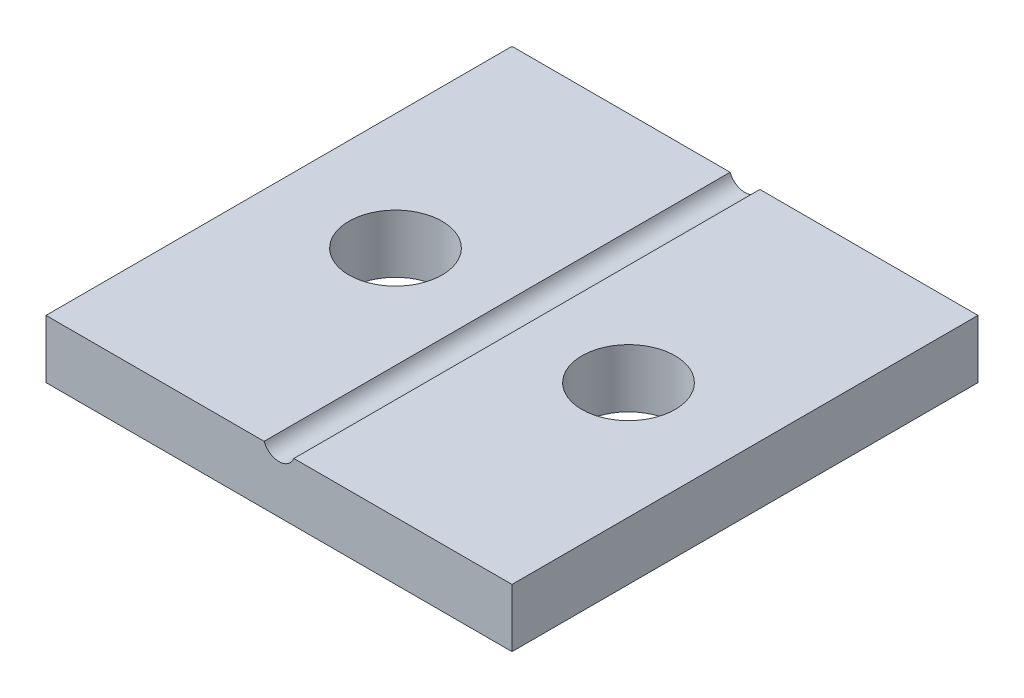
ISO-10303-21;
HEADER;
FILE_DESCRIPTION(('STEP AP214'),'2;1');
FILE_NAME('part.step','',(''),(''),'','','');
FILE_SCHEMA(('AUTOMOTIVE_DESIGN { 1 0 10303 214 1 1 1 1 }'));
ENDSEC;
DATA;
#1=APPLICATION_CONTEXT('core data for automotive mechanical design processes');
#2=APPLICATION_PROTOCOL_DEFINITION('international standard','automotive_design',2000,#1);
#3=PRODUCT_CONTEXT('',#1,'mechanical');
#4=PRODUCT('Part','Part','',(#3));
#5=PRODUCT_RELATED_PRODUCT_CATEGORY('part','',(#4));
#6=PRODUCT_DEFINITION_FORMATION('','',#4);
#7=PRODUCT_DEFINITION_CONTEXT('part definition',#1,'design');
#8=PRODUCT_DEFINITION('design','',#6,#7);
#9=PRODUCT_DEFINITION_SHAPE('','',#8);
#10=(LENGTH_UNIT() NAMED_UNIT(*) SI_UNIT(.MILLI.,.METRE.));
#11=(NAMED_UNIT(*) PLANE_ANGLE_UNIT() SI_UNIT($,.RADIAN.));
#12=(NAMED_UNIT(*) SI_UNIT($,.STERADIAN.) SOLID_ANGLE_UNIT());
#13=UNCERTAINTY_MEASURE_WITH_UNIT(LENGTH_MEASURE(1.E-05),#10,'distance_accuracy_value','');
#14=(GEOMETRIC_REPRESENTATION_CONTEXT(3) GLOBAL_UNCERTAINTY_ASSIGNED_CONTEXT((#13)) GLOBAL_UNIT_ASSIGNED_CONTEXT((#10,
#11,#12)) REPRESENTATION_CONTEXT('',''));
#15=CARTESIAN_POINT('',(0.,0.,0.));
#16=DIRECTION('',(0.,0.,1.));
#17=DIRECTION('',(1.,0.,0.));
#18=AXIS2_PLACEMENT_3D('',#15,#16,#17);
#19=CARTESIAN_POINT('',(0.,2.5,0.));
#20=DIRECTION('',(0.,1.,0.));
#21=DIRECTION('',(0.,0.,1.));
#22=AXIS2_PLACEMENT_3D('',#19,#20,#21);
#23=PLANE('',#22);
#24=CARTESIAN_POINT('',(-55.7547169811321,2.5,-42.0754716981132));
#25=DIRECTION('',(0.,1.,0.));
#26=DIRECTION('',(0.,0.,1.));
#27=AXIS2_PLACEMENT_3D('',#24,#25,#26);
#28=CIRCLE('',#27,2.);
#29=CARTESIAN_POINT('',(-55.7547169811321,2.5,-40.0754716981132));
#30=VERTEX_POINT('',#29);
#31=EDGE_CURVE('E170',#30,#30,#28,.T.);
#32=ORIENTED_EDGE('',*,*,#31,.F.);
#33=EDGE_LOOP('',(#32));
#34=FACE_BOUND('',#33,.T.);
#35=DIRECTION('',(0.,0.,1.));
#36=VECTOR('',#35,1.);
#37=CARTESIAN_POINT('',(-51.3933261260713,2.5,-52.0754716981132));
#38=LINE('',#37,#36);
#39=CARTESIAN_POINT('',(-51.3933261260713,2.5,-52.0754716981132));
#40=VERTEX_POINT('',#39);
#41=CARTESIAN_POINT('',(-51.3933261260713,2.5,-32.0754716981132));
#42=VERTEX_POINT('',#41);
#43=EDGE_CURVE('E11',#40,#42,#38,.T.);
#44=ORIENTED_EDGE('',*,*,#43,.F.);
#45=DIRECTION('',(-1.,0.,0.));
#46=VECTOR('',#45,1.);
#47=CARTESIAN_POINT('',(-60.7547169811321,2.5,-52.0754716981132));
#48=LINE('',#47,#46);
#49=CARTESIAN_POINT('',(-60.7547169811321,2.5,-52.0754716981132));
#50=VERTEX_POINT('',#49);
#51=EDGE_CURVE('E56',#40,#50,#48,.T.);
#52=ORIENTED_EDGE('',*,*,#51,.T.);
#53=DIRECTION('',(0.,0.,1.));
#54=VECTOR('',#53,1.);
#55=CARTESIAN_POINT('',(-60.7547169811321,2.5,-52.0754716981132));
#56=LINE('',#55,#54);
#57=CARTESIAN_POINT('',(-60.7547169811321,2.5,-32.0754716981132));
#58=VERTEX_POINT('',#57);
#59=EDGE_CURVE('E103',#50,#58,#56,.T.);
#60=ORIENTED_EDGE('',*,*,#59,.T.);
#61=DIRECTION('',(1.,0.,0.));
#62=VECTOR('',#61,1.);
#63=CARTESIAN_POINT('',(-60.7547169811321,2.5,-32.0754716981132));
#64=LINE('',#63,#62);
#65=EDGE_CURVE('E85',#58,#42,#64,.T.);
#66=ORIENTED_EDGE('',*,*,#65,.T.);
#67=EDGE_LOOP('',(#44,#52,#60,#66));
#68=FACE_BOUND('',#67,.T.);
#69=ADVANCED_FACE('F33',(#34,#68),#23,.T.);
#70=CARTESIAN_POINT('',(-60.7547169811321,2.5,-52.0754716981132));
#71=DIRECTION('',(1.,0.,0.));
#72=DIRECTION('',(0.,0.,-1.));
#73=AXIS2_PLACEMENT_3D('',#70,#71,#72);
#74=PLANE('',#73);
#75=DIRECTION('',(0.,0.,1.));
#76=VECTOR('',#75,1.);
#77=CARTESIAN_POINT('',(-60.7547169811321,0.,-52.0754716981132));
#78=LINE('',#77,#76);
#79=CARTESIAN_POINT('',(-60.7547169811321,0.,-52.0754716981132));
#80=VERTEX_POINT('',#79);
#81=CARTESIAN_POINT('',(-60.7547169811321,0.,-32.0754716981132));
#82=VERTEX_POINT('',#81);
#83=EDGE_CURVE('E114',#80,#82,#78,.T.);
#84=ORIENTED_EDGE('',*,*,#83,.T.);
#85=DIRECTION('',(0.,-1.,0.));
#86=VECTOR('',#85,1.);
#87=CARTESIAN_POINT('',(-60.7547169811321,2.5,-32.0754716981132));
#88=LINE('',#87,#86);
#89=EDGE_CURVE('E128',#58,#82,#88,.T.);
#90=ORIENTED_EDGE('',*,*,#89,.F.);
#91=ORIENTED_EDGE('',*,*,#59,.F.);
#92=DIRECTION('',(0.,-1.,0.));
#93=VECTOR('',#92,1.);
#94=CARTESIAN_POINT('',(-60.7547169811321,2.5,-52.0754716981132));
#95=LINE('',#94,#93);
#96=EDGE_CURVE('E113',#50,#80,#95,.T.);
#97=ORIENTED_EDGE('',*,*,#96,.T.);
#98=EDGE_LOOP('',(#84,#90,#91,#97));
#99=FACE_BOUND('',#98,.T.);
#100=ADVANCED_FACE('F35',(#99),#74,.F.);
#101=CARTESIAN_POINT('',(-60.7547169811321,2.5,-32.0754716981132));
#102=DIRECTION('',(0.,0.,-1.));
#103=DIRECTION('',(-1.,0.,0.));
#104=AXIS2_PLACEMENT_3D('',#101,#102,#103);
#105=PLANE('',#104);
#106=CARTESIAN_POINT('',(-50.1161078361929,2.5,-32.0754716981132));
#107=VERTEX_POINT('',#106);
#108=CARTESIAN_POINT('',(-40.7547169811321,2.5,-32.0754716981132));
#109=VERTEX_POINT('',#108);
#110=EDGE_CURVE('E99',#107,#109,#64,.T.);
#111=ORIENTED_EDGE('',*,*,#110,.F.);
#112=CARTESIAN_POINT('',(-50.7547169811321,2.75,-32.0754716981132));
#113=DIRECTION('',(0.,0.,1.));
#114=DIRECTION('',(1.,0.,0.));
#115=AXIS2_PLACEMENT_3D('',#112,#113,#114);
#116=CIRCLE('',#115,0.685800000000001);
#117=EDGE_CURVE('E47',#42,#107,#116,.T.);
#118=ORIENTED_EDGE('',*,*,#117,.F.);
#119=ORIENTED_EDGE('',*,*,#65,.F.);
#120=ORIENTED_EDGE('',*,*,#89,.T.);
#121=DIRECTION('',(1.,0.,0.));
#122=VECTOR('',#121,1.);
#123=CARTESIAN_POINT('',(-60.7547169811321,0.,-32.0754716981132));
#124=LINE('',#123,#122);
#125=CARTESIAN_POINT('',(-40.7547169811321,0.,-32.0754716981132));
#126=VERTEX_POINT('',#125);
#127=EDGE_CURVE('E117',#82,#126,#124,.T.);
#128=ORIENTED_EDGE('',*,*,#127,.T.);
#129=DIRECTION('',(0.,-1.,0.));
#130=VECTOR('',#129,1.);
#131=CARTESIAN_POINT('',(-40.7547169811321,2.5,-32.0754716981132));
#132=LINE('',#131,#130);
#133=EDGE_CURVE('E125',#109,#126,#132,.T.);
#134=ORIENTED_EDGE('',*,*,#133,.F.);
#135=EDGE_LOOP('',(#111,#118,#119,#120,#128,#134));
#136=FACE_BOUND('',#135,.T.);
#137=ADVANCED_FACE('F97',(#136),#105,.F.);
#138=CARTESIAN_POINT('',(-40.7547169811321,2.5,-52.0754716981132));
#139=DIRECTION('',(-1.,0.,0.));
#140=DIRECTION('',(0.,0.,1.));
#141=AXIS2_PLACEMENT_3D('',#138,#139,#140);
#142=PLANE('',#141);
#143=DIRECTION('',(0.,0.,-1.));
#144=VECTOR('',#143,1.);
#145=CARTESIAN_POINT('',(-40.7547169811321,0.,-52.0754716981132));
#146=LINE('',#145,#144);
#147=CARTESIAN_POINT('',(-40.7547169811321,0.,-52.0754716981132));
#148=VERTEX_POINT('',#147);
#149=EDGE_CURVE('E119',#126,#148,#146,.T.);
#150=ORIENTED_EDGE('',*,*,#149,.T.);
#151=DIRECTION('',(0.,-1.,0.));
#152=VECTOR('',#151,1.);
#153=CARTESIAN_POINT('',(-40.7547169811321,2.5,-52.0754716981132));
#154=LINE('',#153,#152);
#155=CARTESIAN_POINT('',(-40.7547169811321,2.5,-52.0754716981132));
#156=VERTEX_POINT('',#155);
#157=EDGE_CURVE('E123',#156,#148,#154,.T.);
#158=ORIENTED_EDGE('',*,*,#157,.F.);
#159=DIRECTION('',(0.,0.,-1.));
#160=VECTOR('',#159,1.);
#161=CARTESIAN_POINT('',(-40.7547169811321,2.5,-52.0754716981132));
#162=LINE('',#161,#160);
#163=EDGE_CURVE('E105',#109,#156,#162,.T.);
#164=ORIENTED_EDGE('',*,*,#163,.F.);
#165=ORIENTED_EDGE('',*,*,#133,.T.);
#166=EDGE_LOOP('',(#150,#158,#164,#165));
#167=FACE_BOUND('',#166,.T.);
#168=ADVANCED_FACE('F137',(#167),#142,.F.);
#169=CARTESIAN_POINT('',(-60.7547169811321,2.5,-52.0754716981132));
#170=DIRECTION('',(0.,0.,1.));
#171=DIRECTION('',(1.,0.,0.));
#172=AXIS2_PLACEMENT_3D('',#169,#170,#171);
#173=PLANE('',#172);
#174=ORIENTED_EDGE('',*,*,#51,.F.);
#175=CARTESIAN_POINT('',(-50.7547169811321,2.75,-52.0754716981132));
#176=DIRECTION('',(0.,0.,1.));
#177=DIRECTION('',(1.,0.,0.));
#178=AXIS2_PLACEMENT_3D('',#175,#176,#177);
#179=CIRCLE('',#178,0.685800000000001);
#180=CARTESIAN_POINT('',(-50.1161078361929,2.5,-52.0754716981132));
#181=VERTEX_POINT('',#180);
#182=EDGE_CURVE('E95',#40,#181,#179,.T.);
#183=ORIENTED_EDGE('',*,*,#182,.T.);
#184=EDGE_CURVE('E110',#156,#181,#48,.T.);
#185=ORIENTED_EDGE('',*,*,#184,.F.);
#186=ORIENTED_EDGE('',*,*,#157,.T.);
#187=DIRECTION('',(-1.,0.,0.));
#188=VECTOR('',#187,1.);
#189=CARTESIAN_POINT('',(-60.7547169811321,0.,-52.0754716981132));
#190=LINE('',#189,#188);
#191=EDGE_CURVE('E78',#148,#80,#190,.T.);
#192=ORIENTED_EDGE('',*,*,#191,.T.);
#193=ORIENTED_EDGE('',*,*,#96,.F.);
#194=EDGE_LOOP('',(#174,#183,#185,#186,#192,#193));
#195=FACE_BOUND('',#194,.T.);
#196=ADVANCED_FACE('F131',(#195),#173,.F.);
#197=CARTESIAN_POINT('',(-45.7547169811321,2.5,-42.0754716981132));
#198=DIRECTION('',(0.,1.,0.));
#199=DIRECTION('',(0.,0.,1.));
#200=AXIS2_PLACEMENT_3D('',#197,#198,#199);
#201=CIRCLE('',#200,2.);
#202=CARTESIAN_POINT('',(-45.7547169811321,2.5,-40.0754716981132));
#203=VERTEX_POINT('',#202);
#204=EDGE_CURVE('E165',#203,#203,#201,.T.);
#205=ORIENTED_EDGE('',*,*,#204,.F.);
#206=EDGE_LOOP('',(#205));
#207=FACE_BOUND('',#206,.T.);
#208=DIRECTION('',(0.,0.,1.));
#209=VECTOR('',#208,1.);
#210=CARTESIAN_POINT('',(-50.1161078361929,2.5,-52.0754716981132));
#211=LINE('',#210,#209);
#212=EDGE_CURVE('E41',#107,#181,#211,.F.);
#213=ORIENTED_EDGE('',*,*,#212,.F.);
#214=ORIENTED_EDGE('',*,*,#110,.T.);
#215=ORIENTED_EDGE('',*,*,#163,.T.);
#216=ORIENTED_EDGE('',*,*,#184,.T.);
#217=EDGE_LOOP('',(#213,#214,#215,#216));
#218=FACE_BOUND('',#217,.T.);
#219=ADVANCED_FACE('F133',(#207,#218),#23,.T.);
#220=CARTESIAN_POINT('',(0.,0.,0.));
#221=DIRECTION('',(0.,1.,0.));
#222=DIRECTION('',(0.,0.,1.));
#223=AXIS2_PLACEMENT_3D('',#220,#221,#222);
#224=PLANE('',#223);
#225=CARTESIAN_POINT('',(-45.7547169811321,0.,-42.0754716981132));
#226=DIRECTION('',(0.,1.,0.));
#227=DIRECTION('',(0.,0.,1.));
#228=AXIS2_PLACEMENT_3D('',#225,#226,#227);
#229=CIRCLE('',#228,2.);
#230=CARTESIAN_POINT('',(-45.7547169811321,0.,-40.0754716981132));
#231=VERTEX_POINT('',#230);
#232=EDGE_CURVE('E167',#231,#231,#229,.T.);
#233=ORIENTED_EDGE('',*,*,#232,.T.);
#234=EDGE_LOOP('',(#233));
#235=FACE_BOUND('',#234,.T.);
#236=CARTESIAN_POINT('',(-55.7547169811321,0.,-42.0754716981132));
#237=DIRECTION('',(0.,1.,0.));
#238=DIRECTION('',(0.,0.,1.));
#239=AXIS2_PLACEMENT_3D('',#236,#237,#238);
#240=CIRCLE('',#239,2.);
#241=CARTESIAN_POINT('',(-55.7547169811321,0.,-40.0754716981132));
#242=VERTEX_POINT('',#241);
#243=EDGE_CURVE('E100',#242,#242,#240,.T.);
#244=ORIENTED_EDGE('',*,*,#243,.T.);
#245=EDGE_LOOP('',(#244));
#246=FACE_BOUND('',#245,.T.);
#247=ORIENTED_EDGE('',*,*,#83,.F.);
#248=ORIENTED_EDGE('',*,*,#191,.F.);
#249=ORIENTED_EDGE('',*,*,#149,.F.);
#250=ORIENTED_EDGE('',*,*,#127,.F.);
#251=EDGE_LOOP('',(#247,#248,#249,#250));
#252=FACE_BOUND('',#251,.T.);
#253=ADVANCED_FACE('F141',(#235,#246,#252),#224,.F.);
#254=CARTESIAN_POINT('',(-50.7547169811321,2.75,-52.0754716981132));
#255=DIRECTION('',(0.,0.,1.));
#256=DIRECTION('',(1.,0.,0.));
#257=AXIS2_PLACEMENT_3D('',#254,#255,#256);
#258=CYLINDRICAL_SURFACE('',#257,0.685800000000001);
#259=ORIENTED_EDGE('',*,*,#43,.T.);
#260=ORIENTED_EDGE('',*,*,#117,.T.);
#261=ORIENTED_EDGE('',*,*,#212,.T.);
#262=ORIENTED_EDGE('',*,*,#182,.F.);
#263=EDGE_LOOP('',(#259,#260,#261,#262));
#264=FACE_BOUND('',#263,.T.);
#265=ADVANCED_FACE('F93',(#264),#258,.F.);
#266=CARTESIAN_POINT('',(-55.7547169811321,0.,-42.0754716981132));
#267=DIRECTION('',(0.,1.,0.));
#268=DIRECTION('',(0.,0.,1.));
#269=AXIS2_PLACEMENT_3D('',#266,#267,#268);
#270=CYLINDRICAL_SURFACE('',#269,2.);
#271=ORIENTED_EDGE('',*,*,#243,.F.);
#272=EDGE_LOOP('',(#271));
#273=FACE_BOUND('',#272,.T.);
#274=ORIENTED_EDGE('',*,*,#31,.T.);
#275=EDGE_LOOP('',(#274));
#276=FACE_BOUND('',#275,.T.);
#277=ADVANCED_FACE('F177',(#273,#276),#270,.F.);
#278=CARTESIAN_POINT('',(-45.7547169811321,0.,-42.0754716981132));
#279=DIRECTION('',(0.,1.,0.));
#280=DIRECTION('',(0.,0.,1.));
#281=AXIS2_PLACEMENT_3D('',#278,#279,#280);
#282=CYLINDRICAL_SURFACE('',#281,2.);
#283=ORIENTED_EDGE('',*,*,#232,.F.);
#284=EDGE_LOOP('',(#283));
#285=FACE_BOUND('',#284,.T.);
#286=ORIENTED_EDGE('',*,*,#204,.T.);
#287=EDGE_LOOP('',(#286));
#288=FACE_BOUND('',#287,.T.);
#289=ADVANCED_FACE('F179',(#285,#288),#282,.F.);
#290=CLOSED_SHELL('',(#69,#100,#137,#168,#196,#219,#253,#265,#277,#289));
#291=MANIFOLD_SOLID_BREP('B2',#290);
#292=ADVANCED_BREP_SHAPE_REPRESENTATION('',(#18,#291),#14);
#293=SHAPE_DEFINITION_REPRESENTATION(#9,#292);
ENDSEC;
END-ISO-10303-21;
